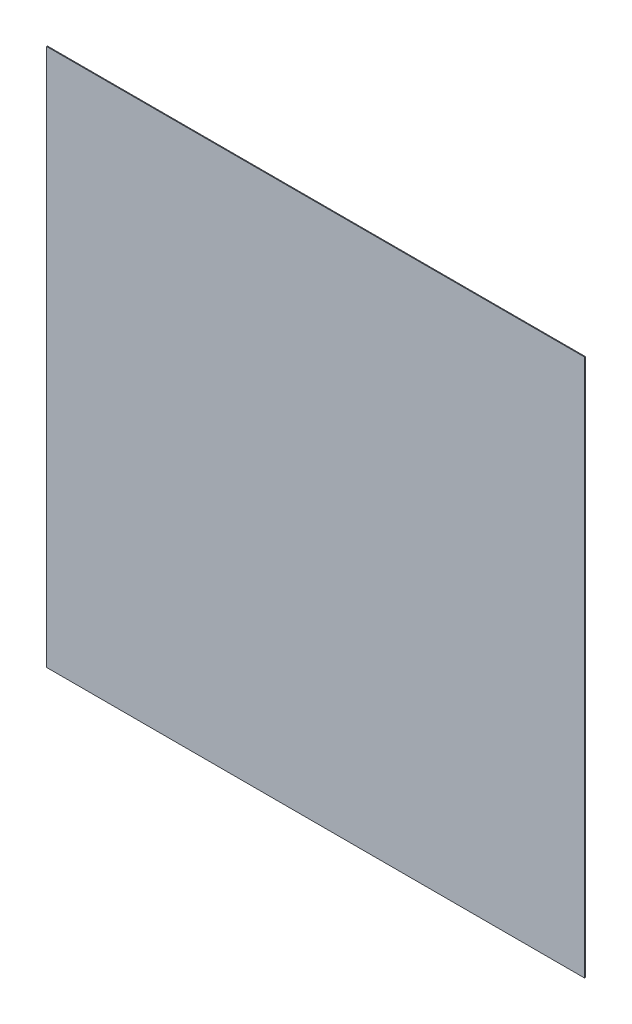
ISO-10303-21;
HEADER;
FILE_DESCRIPTION(('STEP AP214'),'2;1');
FILE_NAME('part.step','',(''),(''),'','','');
FILE_SCHEMA(('AUTOMOTIVE_DESIGN { 1 0 10303 214 1 1 1 1 }'));
ENDSEC;
DATA;
#1=APPLICATION_CONTEXT('core data for automotive mechanical design processes');
#2=APPLICATION_PROTOCOL_DEFINITION('international standard','automotive_design',2000,#1);
#3=PRODUCT_CONTEXT('',#1,'mechanical');
#4=PRODUCT('Part','Part','',(#3));
#5=PRODUCT_RELATED_PRODUCT_CATEGORY('part','',(#4));
#6=PRODUCT_DEFINITION_FORMATION('','',#4);
#7=PRODUCT_DEFINITION_CONTEXT('part definition',#1,'design');
#8=PRODUCT_DEFINITION('design','',#6,#7);
#9=PRODUCT_DEFINITION_SHAPE('','',#8);
#10=(LENGTH_UNIT() NAMED_UNIT(*) SI_UNIT(.MILLI.,.METRE.));
#11=(NAMED_UNIT(*) PLANE_ANGLE_UNIT() SI_UNIT($,.RADIAN.));
#12=(NAMED_UNIT(*) SI_UNIT($,.STERADIAN.) SOLID_ANGLE_UNIT());
#13=UNCERTAINTY_MEASURE_WITH_UNIT(LENGTH_MEASURE(1.E-05),#10,'distance_accuracy_value','');
#14=(GEOMETRIC_REPRESENTATION_CONTEXT(3) GLOBAL_UNCERTAINTY_ASSIGNED_CONTEXT((#13)) GLOBAL_UNIT_ASSIGNED_CONTEXT((#10,
#11,#12)) REPRESENTATION_CONTEXT('',''));
#15=CARTESIAN_POINT('',(0.,0.,0.));
#16=DIRECTION('',(0.,0.,1.));
#17=DIRECTION('',(1.,0.,0.));
#18=AXIS2_PLACEMENT_3D('',#15,#16,#17);
#19=CARTESIAN_POINT('',(-31.75,31.75,0.1));
#20=DIRECTION('',(1.,0.,0.));
#21=DIRECTION('',(0.,1.,0.));
#22=AXIS2_PLACEMENT_3D('',#19,#20,#21);
#23=PLANE('',#22);
#24=DIRECTION('',(0.,-1.,0.));
#25=VECTOR('',#24,1.);
#26=CARTESIAN_POINT('',(-31.75,31.75,0.));
#27=LINE('',#26,#25);
#28=CARTESIAN_POINT('',(-31.75,31.75,0.));
#29=VERTEX_POINT('',#28);
#30=CARTESIAN_POINT('',(-31.75,-31.75,0.));
#31=VERTEX_POINT('',#30);
#32=EDGE_CURVE('E96',#29,#31,#27,.T.);
#33=ORIENTED_EDGE('',*,*,#32,.T.);
#34=DIRECTION('',(0.,0.,-1.));
#35=VECTOR('',#34,1.);
#36=CARTESIAN_POINT('',(-31.75,-31.75,0.1));
#37=LINE('',#36,#35);
#38=CARTESIAN_POINT('',(-31.75,-31.75,0.1));
#39=VERTEX_POINT('',#38);
#40=EDGE_CURVE('E11',#39,#31,#37,.T.);
#41=ORIENTED_EDGE('',*,*,#40,.F.);
#42=DIRECTION('',(0.,-1.,0.));
#43=VECTOR('',#42,1.);
#44=CARTESIAN_POINT('',(-31.75,31.75,0.1));
#45=LINE('',#44,#43);
#46=CARTESIAN_POINT('',(-31.75,31.75,0.1));
#47=VERTEX_POINT('',#46);
#48=EDGE_CURVE('E84',#47,#39,#45,.T.);
#49=ORIENTED_EDGE('',*,*,#48,.F.);
#50=DIRECTION('',(0.,0.,-1.));
#51=VECTOR('',#50,1.);
#52=CARTESIAN_POINT('',(-31.75,31.75,0.1));
#53=LINE('',#52,#51);
#54=EDGE_CURVE('E92',#47,#29,#53,.T.);
#55=ORIENTED_EDGE('',*,*,#54,.T.);
#56=EDGE_LOOP('',(#33,#41,#49,#55));
#57=FACE_BOUND('',#56,.T.);
#58=ADVANCED_FACE('F33',(#57),#23,.F.);
#59=CARTESIAN_POINT('',(-31.75,-31.75,0.1));
#60=DIRECTION('',(0.,1.,0.));
#61=DIRECTION('',(-1.,0.,0.));
#62=AXIS2_PLACEMENT_3D('',#59,#60,#61);
#63=PLANE('',#62);
#64=DIRECTION('',(1.,0.,0.));
#65=VECTOR('',#64,1.);
#66=CARTESIAN_POINT('',(-31.75,-31.75,0.));
#67=LINE('',#66,#65);
#68=CARTESIAN_POINT('',(31.75,-31.75,0.));
#69=VERTEX_POINT('',#68);
#70=EDGE_CURVE('E88',#31,#69,#67,.T.);
#71=ORIENTED_EDGE('',*,*,#70,.T.);
#72=DIRECTION('',(0.,0.,-1.));
#73=VECTOR('',#72,1.);
#74=CARTESIAN_POINT('',(31.75,-31.75,0.1));
#75=LINE('',#74,#73);
#76=CARTESIAN_POINT('',(31.75,-31.75,0.1));
#77=VERTEX_POINT('',#76);
#78=EDGE_CURVE('E41',#77,#69,#75,.T.);
#79=ORIENTED_EDGE('',*,*,#78,.F.);
#80=DIRECTION('',(1.,0.,0.));
#81=VECTOR('',#80,1.);
#82=CARTESIAN_POINT('',(-31.75,-31.75,0.1));
#83=LINE('',#82,#81);
#84=EDGE_CURVE('E79',#39,#77,#83,.T.);
#85=ORIENTED_EDGE('',*,*,#84,.F.);
#86=ORIENTED_EDGE('',*,*,#40,.T.);
#87=EDGE_LOOP('',(#71,#79,#85,#86));
#88=FACE_BOUND('',#87,.T.);
#89=ADVANCED_FACE('F87',(#88),#63,.F.);
#90=CARTESIAN_POINT('',(31.75,31.75,0.1));
#91=DIRECTION('',(-1.,0.,0.));
#92=DIRECTION('',(0.,-1.,0.));
#93=AXIS2_PLACEMENT_3D('',#90,#91,#92);
#94=PLANE('',#93);
#95=DIRECTION('',(0.,1.,0.));
#96=VECTOR('',#95,1.);
#97=CARTESIAN_POINT('',(31.75,31.75,0.));
#98=LINE('',#97,#96);
#99=CARTESIAN_POINT('',(31.75,31.75,0.));
#100=VERTEX_POINT('',#99);
#101=EDGE_CURVE('E66',#69,#100,#98,.T.);
#102=ORIENTED_EDGE('',*,*,#101,.T.);
#103=DIRECTION('',(0.,0.,-1.));
#104=VECTOR('',#103,1.);
#105=CARTESIAN_POINT('',(31.75,31.75,0.1));
#106=LINE('',#105,#104);
#107=CARTESIAN_POINT('',(31.75,31.75,0.1));
#108=VERTEX_POINT('',#107);
#109=EDGE_CURVE('E89',#108,#100,#106,.T.);
#110=ORIENTED_EDGE('',*,*,#109,.F.);
#111=DIRECTION('',(0.,1.,0.));
#112=VECTOR('',#111,1.);
#113=CARTESIAN_POINT('',(31.75,31.75,0.1));
#114=LINE('',#113,#112);
#115=EDGE_CURVE('E82',#77,#108,#114,.T.);
#116=ORIENTED_EDGE('',*,*,#115,.F.);
#117=ORIENTED_EDGE('',*,*,#78,.T.);
#118=EDGE_LOOP('',(#102,#110,#116,#117));
#119=FACE_BOUND('',#118,.T.);
#120=ADVANCED_FACE('F90',(#119),#94,.F.);
#121=CARTESIAN_POINT('',(-31.75,31.75,0.1));
#122=DIRECTION('',(0.,-1.,0.));
#123=DIRECTION('',(1.,0.,0.));
#124=AXIS2_PLACEMENT_3D('',#121,#122,#123);
#125=PLANE('',#124);
#126=DIRECTION('',(-1.,0.,0.));
#127=VECTOR('',#126,1.);
#128=CARTESIAN_POINT('',(-31.75,31.75,0.));
#129=LINE('',#128,#127);
#130=EDGE_CURVE('E72',#100,#29,#129,.T.);
#131=ORIENTED_EDGE('',*,*,#130,.T.);
#132=ORIENTED_EDGE('',*,*,#54,.F.);
#133=DIRECTION('',(-1.,0.,0.));
#134=VECTOR('',#133,1.);
#135=CARTESIAN_POINT('',(-31.75,31.75,0.1));
#136=LINE('',#135,#134);
#137=EDGE_CURVE('E49',#108,#47,#136,.T.);
#138=ORIENTED_EDGE('',*,*,#137,.F.);
#139=ORIENTED_EDGE('',*,*,#109,.T.);
#140=EDGE_LOOP('',(#131,#132,#138,#139));
#141=FACE_BOUND('',#140,.T.);
#142=ADVANCED_FACE('F103',(#141),#125,.F.);
#143=CARTESIAN_POINT('',(0.,0.,0.1));
#144=DIRECTION('',(0.,0.,1.));
#145=DIRECTION('',(1.,0.,0.));
#146=AXIS2_PLACEMENT_3D('',#143,#144,#145);
#147=PLANE('',#146);
#148=ORIENTED_EDGE('',*,*,#48,.T.);
#149=ORIENTED_EDGE('',*,*,#84,.T.);
#150=ORIENTED_EDGE('',*,*,#115,.T.);
#151=ORIENTED_EDGE('',*,*,#137,.T.);
#152=EDGE_LOOP('',(#148,#149,#150,#151));
#153=FACE_BOUND('',#152,.T.);
#154=ADVANCED_FACE('F80',(#153),#147,.T.);
#155=CARTESIAN_POINT('',(0.,0.,0.));
#156=DIRECTION('',(0.,0.,1.));
#157=DIRECTION('',(1.,0.,0.));
#158=AXIS2_PLACEMENT_3D('',#155,#156,#157);
#159=PLANE('',#158);
#160=ORIENTED_EDGE('',*,*,#32,.F.);
#161=ORIENTED_EDGE('',*,*,#130,.F.);
#162=ORIENTED_EDGE('',*,*,#101,.F.);
#163=ORIENTED_EDGE('',*,*,#70,.F.);
#164=EDGE_LOOP('',(#160,#161,#162,#163));
#165=FACE_BOUND('',#164,.T.);
#166=ADVANCED_FACE('F106',(#165),#159,.F.);
#167=CLOSED_SHELL('',(#58,#89,#120,#142,#154,#166));
#168=MANIFOLD_SOLID_BREP('B2',#167);
#169=ADVANCED_BREP_SHAPE_REPRESENTATION('',(#18,#168),#14);
#170=SHAPE_DEFINITION_REPRESENTATION(#9,#169);
ENDSEC;
END-ISO-10303-21;
